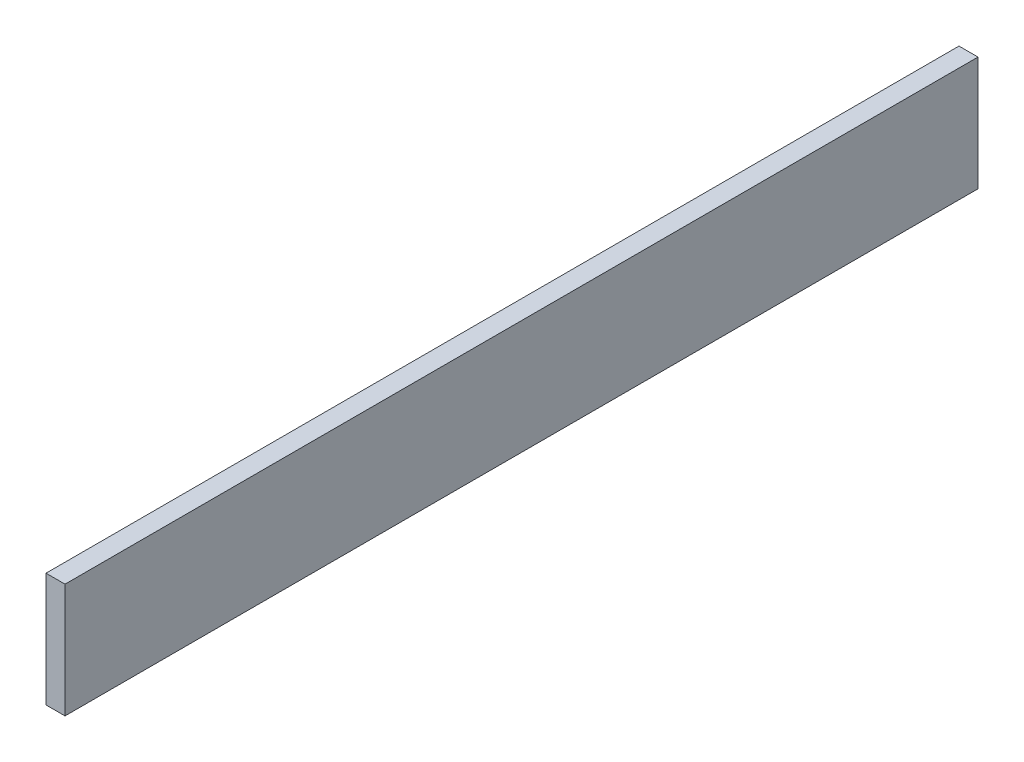
ISO-10303-21;
HEADER;
FILE_DESCRIPTION(('STEP AP214'),'2;1');
FILE_NAME('part.step','',(''),(''),'','','');
FILE_SCHEMA(('AUTOMOTIVE_DESIGN { 1 0 10303 214 1 1 1 1 }'));
ENDSEC;
DATA;
#1=APPLICATION_CONTEXT('core data for automotive mechanical design processes');
#2=APPLICATION_PROTOCOL_DEFINITION('international standard','automotive_design',2000,#1);
#3=PRODUCT_CONTEXT('',#1,'mechanical');
#4=PRODUCT('Part','Part','',(#3));
#5=PRODUCT_RELATED_PRODUCT_CATEGORY('part','',(#4));
#6=PRODUCT_DEFINITION_FORMATION('','',#4);
#7=PRODUCT_DEFINITION_CONTEXT('part definition',#1,'design');
#8=PRODUCT_DEFINITION('design','',#6,#7);
#9=PRODUCT_DEFINITION_SHAPE('','',#8);
#10=(LENGTH_UNIT() NAMED_UNIT(*) SI_UNIT(.MILLI.,.METRE.));
#11=(NAMED_UNIT(*) PLANE_ANGLE_UNIT() SI_UNIT($,.RADIAN.));
#12=(NAMED_UNIT(*) SI_UNIT($,.STERADIAN.) SOLID_ANGLE_UNIT());
#13=UNCERTAINTY_MEASURE_WITH_UNIT(LENGTH_MEASURE(1.E-05),#10,'distance_accuracy_value','');
#14=(GEOMETRIC_REPRESENTATION_CONTEXT(3) GLOBAL_UNCERTAINTY_ASSIGNED_CONTEXT((#13)) GLOBAL_UNIT_ASSIGNED_CONTEXT((#10,
#11,#12)) REPRESENTATION_CONTEXT('',''));
#15=CARTESIAN_POINT('',(0.,0.,0.));
#16=DIRECTION('',(0.,0.,1.));
#17=DIRECTION('',(1.,0.,0.));
#18=AXIS2_PLACEMENT_3D('',#15,#16,#17);
#19=CARTESIAN_POINT('',(6.35,38.1,152.4));
#20=DIRECTION('',(0.,0.,-1.));
#21=DIRECTION('',(-1.,0.,0.));
#22=AXIS2_PLACEMENT_3D('',#19,#20,#21);
#23=PLANE('',#22);
#24=DIRECTION('',(0.,-1.,0.));
#25=VECTOR('',#24,1.);
#26=CARTESIAN_POINT('',(0.,38.1,152.4));
#27=LINE('',#26,#25);
#28=CARTESIAN_POINT('',(0.,38.1,152.4));
#29=VERTEX_POINT('',#28);
#30=CARTESIAN_POINT('',(0.,0.,152.4));
#31=VERTEX_POINT('',#30);
#32=EDGE_CURVE('E96',#29,#31,#27,.T.);
#33=ORIENTED_EDGE('',*,*,#32,.T.);
#34=DIRECTION('',(-1.,0.,0.));
#35=VECTOR('',#34,1.);
#36=CARTESIAN_POINT('',(6.35,0.,152.4));
#37=LINE('',#36,#35);
#38=CARTESIAN_POINT('',(6.35,0.,152.4));
#39=VERTEX_POINT('',#38);
#40=EDGE_CURVE('E11',#39,#31,#37,.T.);
#41=ORIENTED_EDGE('',*,*,#40,.F.);
#42=DIRECTION('',(0.,-1.,0.));
#43=VECTOR('',#42,1.);
#44=CARTESIAN_POINT('',(6.35,38.1,152.4));
#45=LINE('',#44,#43);
#46=CARTESIAN_POINT('',(6.35,38.1,152.4));
#47=VERTEX_POINT('',#46);
#48=EDGE_CURVE('E84',#47,#39,#45,.T.);
#49=ORIENTED_EDGE('',*,*,#48,.F.);
#50=DIRECTION('',(-1.,0.,0.));
#51=VECTOR('',#50,1.);
#52=CARTESIAN_POINT('',(6.35,38.1,152.4));
#53=LINE('',#52,#51);
#54=EDGE_CURVE('E92',#47,#29,#53,.T.);
#55=ORIENTED_EDGE('',*,*,#54,.T.);
#56=EDGE_LOOP('',(#33,#41,#49,#55));
#57=FACE_BOUND('',#56,.T.);
#58=ADVANCED_FACE('F33',(#57),#23,.F.);
#59=CARTESIAN_POINT('',(6.35,0.,152.4));
#60=DIRECTION('',(0.,1.,0.));
#61=DIRECTION('',(0.,0.,1.));
#62=AXIS2_PLACEMENT_3D('',#59,#60,#61);
#63=PLANE('',#62);
#64=DIRECTION('',(0.,0.,-1.));
#65=VECTOR('',#64,1.);
#66=CARTESIAN_POINT('',(0.,0.,152.4));
#67=LINE('',#66,#65);
#68=CARTESIAN_POINT('',(0.,0.,-152.4));
#69=VERTEX_POINT('',#68);
#70=EDGE_CURVE('E88',#31,#69,#67,.T.);
#71=ORIENTED_EDGE('',*,*,#70,.T.);
#72=DIRECTION('',(-1.,0.,0.));
#73=VECTOR('',#72,1.);
#74=CARTESIAN_POINT('',(6.35,0.,-152.4));
#75=LINE('',#74,#73);
#76=CARTESIAN_POINT('',(6.35,0.,-152.4));
#77=VERTEX_POINT('',#76);
#78=EDGE_CURVE('E41',#77,#69,#75,.T.);
#79=ORIENTED_EDGE('',*,*,#78,.F.);
#80=DIRECTION('',(0.,0.,-1.));
#81=VECTOR('',#80,1.);
#82=CARTESIAN_POINT('',(6.35,0.,152.4));
#83=LINE('',#82,#81);
#84=EDGE_CURVE('E79',#39,#77,#83,.T.);
#85=ORIENTED_EDGE('',*,*,#84,.F.);
#86=ORIENTED_EDGE('',*,*,#40,.T.);
#87=EDGE_LOOP('',(#71,#79,#85,#86));
#88=FACE_BOUND('',#87,.T.);
#89=ADVANCED_FACE('F87',(#88),#63,.F.);
#90=CARTESIAN_POINT('',(6.35,38.1,-152.4));
#91=DIRECTION('',(0.,0.,1.));
#92=DIRECTION('',(1.,0.,0.));
#93=AXIS2_PLACEMENT_3D('',#90,#91,#92);
#94=PLANE('',#93);
#95=DIRECTION('',(0.,1.,0.));
#96=VECTOR('',#95,1.);
#97=CARTESIAN_POINT('',(0.,38.1,-152.4));
#98=LINE('',#97,#96);
#99=CARTESIAN_POINT('',(0.,38.1,-152.4));
#100=VERTEX_POINT('',#99);
#101=EDGE_CURVE('E66',#69,#100,#98,.T.);
#102=ORIENTED_EDGE('',*,*,#101,.T.);
#103=DIRECTION('',(-1.,0.,0.));
#104=VECTOR('',#103,1.);
#105=CARTESIAN_POINT('',(6.35,38.1,-152.4));
#106=LINE('',#105,#104);
#107=CARTESIAN_POINT('',(6.35,38.1,-152.4));
#108=VERTEX_POINT('',#107);
#109=EDGE_CURVE('E89',#108,#100,#106,.T.);
#110=ORIENTED_EDGE('',*,*,#109,.F.);
#111=DIRECTION('',(0.,1.,0.));
#112=VECTOR('',#111,1.);
#113=CARTESIAN_POINT('',(6.35,38.1,-152.4));
#114=LINE('',#113,#112);
#115=EDGE_CURVE('E82',#77,#108,#114,.T.);
#116=ORIENTED_EDGE('',*,*,#115,.F.);
#117=ORIENTED_EDGE('',*,*,#78,.T.);
#118=EDGE_LOOP('',(#102,#110,#116,#117));
#119=FACE_BOUND('',#118,.T.);
#120=ADVANCED_FACE('F90',(#119),#94,.F.);
#121=CARTESIAN_POINT('',(6.35,38.1,152.4));
#122=DIRECTION('',(0.,-1.,0.));
#123=DIRECTION('',(0.,0.,-1.));
#124=AXIS2_PLACEMENT_3D('',#121,#122,#123);
#125=PLANE('',#124);
#126=DIRECTION('',(0.,0.,1.));
#127=VECTOR('',#126,1.);
#128=CARTESIAN_POINT('',(0.,38.1,152.4));
#129=LINE('',#128,#127);
#130=EDGE_CURVE('E72',#100,#29,#129,.T.);
#131=ORIENTED_EDGE('',*,*,#130,.T.);
#132=ORIENTED_EDGE('',*,*,#54,.F.);
#133=DIRECTION('',(0.,0.,1.));
#134=VECTOR('',#133,1.);
#135=CARTESIAN_POINT('',(6.35,38.1,152.4));
#136=LINE('',#135,#134);
#137=EDGE_CURVE('E49',#108,#47,#136,.T.);
#138=ORIENTED_EDGE('',*,*,#137,.F.);
#139=ORIENTED_EDGE('',*,*,#109,.T.);
#140=EDGE_LOOP('',(#131,#132,#138,#139));
#141=FACE_BOUND('',#140,.T.);
#142=ADVANCED_FACE('F103',(#141),#125,.F.);
#143=CARTESIAN_POINT('',(6.35,0.,0.));
#144=DIRECTION('',(1.,0.,0.));
#145=DIRECTION('',(0.,0.,-1.));
#146=AXIS2_PLACEMENT_3D('',#143,#144,#145);
#147=PLANE('',#146);
#148=ORIENTED_EDGE('',*,*,#48,.T.);
#149=ORIENTED_EDGE('',*,*,#84,.T.);
#150=ORIENTED_EDGE('',*,*,#115,.T.);
#151=ORIENTED_EDGE('',*,*,#137,.T.);
#152=EDGE_LOOP('',(#148,#149,#150,#151));
#153=FACE_BOUND('',#152,.T.);
#154=ADVANCED_FACE('F80',(#153),#147,.T.);
#155=CARTESIAN_POINT('',(0.,0.,0.));
#156=DIRECTION('',(1.,0.,0.));
#157=DIRECTION('',(0.,0.,-1.));
#158=AXIS2_PLACEMENT_3D('',#155,#156,#157);
#159=PLANE('',#158);
#160=ORIENTED_EDGE('',*,*,#32,.F.);
#161=ORIENTED_EDGE('',*,*,#130,.F.);
#162=ORIENTED_EDGE('',*,*,#101,.F.);
#163=ORIENTED_EDGE('',*,*,#70,.F.);
#164=EDGE_LOOP('',(#160,#161,#162,#163));
#165=FACE_BOUND('',#164,.T.);
#166=ADVANCED_FACE('F106',(#165),#159,.F.);
#167=CLOSED_SHELL('',(#58,#89,#120,#142,#154,#166));
#168=MANIFOLD_SOLID_BREP('B2',#167);
#169=ADVANCED_BREP_SHAPE_REPRESENTATION('',(#18,#168),#14);
#170=SHAPE_DEFINITION_REPRESENTATION(#9,#169);
ENDSEC;
END-ISO-10303-21;
